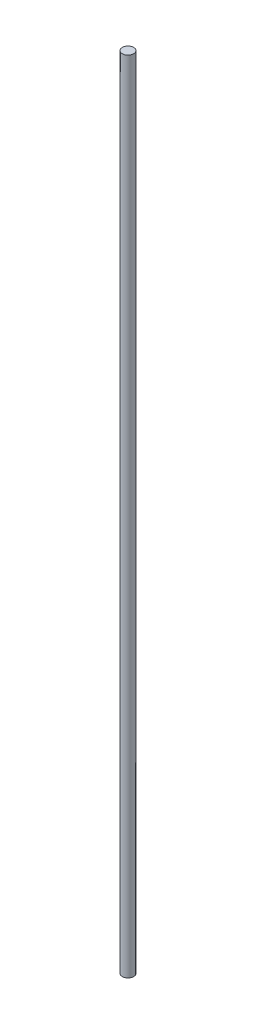
ISO-10303-21;
HEADER;
FILE_DESCRIPTION(('STEP AP214'),'2;1');
FILE_NAME('part.step','',(''),(''),'','','');
FILE_SCHEMA(('AUTOMOTIVE_DESIGN { 1 0 10303 214 1 1 1 1 }'));
ENDSEC;
DATA;
#1=APPLICATION_CONTEXT('core data for automotive mechanical design processes');
#2=APPLICATION_PROTOCOL_DEFINITION('international standard','automotive_design',2000,#1);
#3=PRODUCT_CONTEXT('',#1,'mechanical');
#4=PRODUCT('Part','Part','',(#3));
#5=PRODUCT_RELATED_PRODUCT_CATEGORY('part','',(#4));
#6=PRODUCT_DEFINITION_FORMATION('','',#4);
#7=PRODUCT_DEFINITION_CONTEXT('part definition',#1,'design');
#8=PRODUCT_DEFINITION('design','',#6,#7);
#9=PRODUCT_DEFINITION_SHAPE('','',#8);
#10=(LENGTH_UNIT() NAMED_UNIT(*) SI_UNIT(.MILLI.,.METRE.));
#11=(NAMED_UNIT(*) PLANE_ANGLE_UNIT() SI_UNIT($,.RADIAN.));
#12=(NAMED_UNIT(*) SI_UNIT($,.STERADIAN.) SOLID_ANGLE_UNIT());
#13=UNCERTAINTY_MEASURE_WITH_UNIT(LENGTH_MEASURE(1.E-05),#10,'distance_accuracy_value','');
#14=(GEOMETRIC_REPRESENTATION_CONTEXT(3) GLOBAL_UNCERTAINTY_ASSIGNED_CONTEXT((#13)) GLOBAL_UNIT_ASSIGNED_CONTEXT((#10,
#11,#12)) REPRESENTATION_CONTEXT('',''));
#15=CARTESIAN_POINT('',(0.,0.,0.));
#16=DIRECTION('',(0.,0.,1.));
#17=DIRECTION('',(1.,0.,0.));
#18=AXIS2_PLACEMENT_3D('',#15,#16,#17);
#19=CARTESIAN_POINT('',(0.,570.,0.));
#20=DIRECTION('',(0.,-1.,0.));
#21=DIRECTION('',(0.,0.,-1.));
#22=AXIS2_PLACEMENT_3D('',#19,#20,#21);
#23=CYLINDRICAL_SURFACE('',#22,4.);
#24=CARTESIAN_POINT('',(0.,570.,0.));
#25=DIRECTION('',(0.,1.,0.));
#26=DIRECTION('',(0.,0.,1.));
#27=AXIS2_PLACEMENT_3D('',#24,#25,#26);
#28=CIRCLE('',#27,4.);
#29=CARTESIAN_POINT('',(0.,570.,4.));
#30=VERTEX_POINT('',#29);
#31=EDGE_CURVE('E10',#30,#30,#28,.T.);
#32=ORIENTED_EDGE('',*,*,#31,.F.);
#33=EDGE_LOOP('',(#32));
#34=FACE_BOUND('',#33,.T.);
#35=CARTESIAN_POINT('',(0.,0.,0.));
#36=DIRECTION('',(0.,1.,0.));
#37=DIRECTION('',(0.,0.,1.));
#38=AXIS2_PLACEMENT_3D('',#35,#36,#37);
#39=CIRCLE('',#38,4.);
#40=CARTESIAN_POINT('',(0.,0.,4.));
#41=VERTEX_POINT('',#40);
#42=EDGE_CURVE('E33',#41,#41,#39,.T.);
#43=ORIENTED_EDGE('',*,*,#42,.T.);
#44=EDGE_LOOP('',(#43));
#45=FACE_BOUND('',#44,.T.);
#46=ADVANCED_FACE('F30',(#34,#45),#23,.T.);
#47=CARTESIAN_POINT('',(0.,570.,0.));
#48=DIRECTION('',(0.,1.,0.));
#49=DIRECTION('',(0.,0.,1.));
#50=AXIS2_PLACEMENT_3D('',#47,#48,#49);
#51=PLANE('',#50);
#52=ORIENTED_EDGE('',*,*,#31,.T.);
#53=EDGE_LOOP('',(#52));
#54=FACE_BOUND('',#53,.T.);
#55=ADVANCED_FACE('F45',(#54),#51,.T.);
#56=CARTESIAN_POINT('',(0.,0.,0.));
#57=DIRECTION('',(0.,1.,0.));
#58=DIRECTION('',(0.,0.,1.));
#59=AXIS2_PLACEMENT_3D('',#56,#57,#58);
#60=PLANE('',#59);
#61=ORIENTED_EDGE('',*,*,#42,.F.);
#62=EDGE_LOOP('',(#61));
#63=FACE_BOUND('',#62,.T.);
#64=ADVANCED_FACE('F43',(#63),#60,.F.);
#65=CLOSED_SHELL('',(#46,#55,#64));
#66=MANIFOLD_SOLID_BREP('B2',#65);
#67=ADVANCED_BREP_SHAPE_REPRESENTATION('',(#18,#66),#14);
#68=SHAPE_DEFINITION_REPRESENTATION(#9,#67);
ENDSEC;
END-ISO-10303-21;
